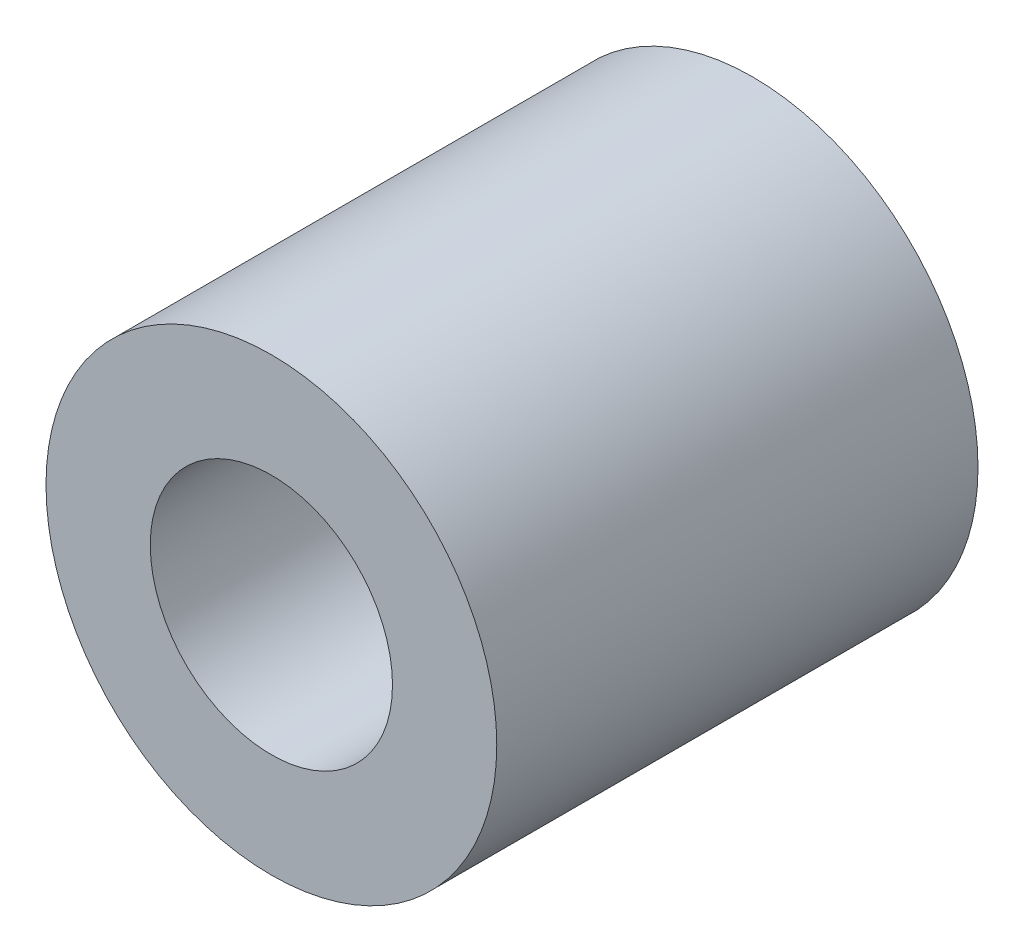
ISO-10303-21;
HEADER;
FILE_DESCRIPTION(('STEP AP214'),'2;1');
FILE_NAME('part.step','',(''),(''),'','','');
FILE_SCHEMA(('AUTOMOTIVE_DESIGN { 1 0 10303 214 1 1 1 1 }'));
ENDSEC;
DATA;
#1=APPLICATION_CONTEXT('core data for automotive mechanical design processes');
#2=APPLICATION_PROTOCOL_DEFINITION('international standard','automotive_design',2000,#1);
#3=PRODUCT_CONTEXT('',#1,'mechanical');
#4=PRODUCT('Part','Part','',(#3));
#5=PRODUCT_RELATED_PRODUCT_CATEGORY('part','',(#4));
#6=PRODUCT_DEFINITION_FORMATION('','',#4);
#7=PRODUCT_DEFINITION_CONTEXT('part definition',#1,'design');
#8=PRODUCT_DEFINITION('design','',#6,#7);
#9=PRODUCT_DEFINITION_SHAPE('','',#8);
#10=(LENGTH_UNIT() NAMED_UNIT(*) SI_UNIT(.MILLI.,.METRE.));
#11=(NAMED_UNIT(*) PLANE_ANGLE_UNIT() SI_UNIT($,.RADIAN.));
#12=(NAMED_UNIT(*) SI_UNIT($,.STERADIAN.) SOLID_ANGLE_UNIT());
#13=UNCERTAINTY_MEASURE_WITH_UNIT(LENGTH_MEASURE(1.E-05),#10,'distance_accuracy_value','');
#14=(GEOMETRIC_REPRESENTATION_CONTEXT(3) GLOBAL_UNCERTAINTY_ASSIGNED_CONTEXT((#13)) GLOBAL_UNIT_ASSIGNED_CONTEXT((#10,
#11,#12)) REPRESENTATION_CONTEXT('',''));
#15=CARTESIAN_POINT('',(0.,0.,0.));
#16=DIRECTION('',(0.,0.,1.));
#17=DIRECTION('',(1.,0.,0.));
#18=AXIS2_PLACEMENT_3D('',#15,#16,#17);
#19=CARTESIAN_POINT('',(0.,0.,3.));
#20=DIRECTION('',(0.,0.,-1.));
#21=DIRECTION('',(-1.,0.,0.));
#22=AXIS2_PLACEMENT_3D('',#19,#20,#21);
#23=CYLINDRICAL_SURFACE('',#22,1.405);
#24=CARTESIAN_POINT('',(0.,0.,3.));
#25=DIRECTION('',(0.,0.,1.));
#26=DIRECTION('',(1.,0.,0.));
#27=AXIS2_PLACEMENT_3D('',#24,#25,#26);
#28=CIRCLE('',#27,1.405);
#29=CARTESIAN_POINT('',(1.405,0.,3.));
#30=VERTEX_POINT('',#29);
#31=EDGE_CURVE('E10',#30,#30,#28,.T.);
#32=ORIENTED_EDGE('',*,*,#31,.F.);
#33=EDGE_LOOP('',(#32));
#34=FACE_BOUND('',#33,.T.);
#35=CARTESIAN_POINT('',(0.,0.,0.));
#36=DIRECTION('',(0.,0.,1.));
#37=DIRECTION('',(1.,0.,0.));
#38=AXIS2_PLACEMENT_3D('',#35,#36,#37);
#39=CIRCLE('',#38,1.405);
#40=CARTESIAN_POINT('',(1.405,0.,0.));
#41=VERTEX_POINT('',#40);
#42=EDGE_CURVE('E40',#41,#41,#39,.T.);
#43=ORIENTED_EDGE('',*,*,#42,.T.);
#44=EDGE_LOOP('',(#43));
#45=FACE_BOUND('',#44,.T.);
#46=ADVANCED_FACE('F37',(#34,#45),#23,.T.);
#47=CARTESIAN_POINT('',(0.,0.,3.));
#48=DIRECTION('',(0.,0.,1.));
#49=DIRECTION('',(1.,0.,0.));
#50=AXIS2_PLACEMENT_3D('',#47,#48,#49);
#51=PLANE('',#50);
#52=CARTESIAN_POINT('',(0.,0.,3.));
#53=DIRECTION('',(0.,0.,1.));
#54=DIRECTION('',(1.,0.,0.));
#55=AXIS2_PLACEMENT_3D('',#52,#53,#54);
#56=CIRCLE('',#55,0.755);
#57=CARTESIAN_POINT('',(0.755,0.,3.));
#58=VERTEX_POINT('',#57);
#59=EDGE_CURVE('E51',#58,#58,#56,.T.);
#60=ORIENTED_EDGE('',*,*,#59,.F.);
#61=EDGE_LOOP('',(#60));
#62=FACE_BOUND('',#61,.T.);
#63=ORIENTED_EDGE('',*,*,#31,.T.);
#64=EDGE_LOOP('',(#63));
#65=FACE_BOUND('',#64,.T.);
#66=ADVANCED_FACE('F68',(#62,#65),#51,.T.);
#67=CARTESIAN_POINT('',(0.,0.,0.));
#68=DIRECTION('',(0.,0.,1.));
#69=DIRECTION('',(1.,0.,0.));
#70=AXIS2_PLACEMENT_3D('',#67,#68,#69);
#71=PLANE('',#70);
#72=ORIENTED_EDGE('',*,*,#42,.F.);
#73=EDGE_LOOP('',(#72));
#74=FACE_BOUND('',#73,.T.);
#75=ADVANCED_FACE('F64',(#74),#71,.F.);
#76=CARTESIAN_POINT('',(0.,0.,0.2));
#77=DIRECTION('',(0.,0.,1.));
#78=DIRECTION('',(1.,0.,0.));
#79=AXIS2_PLACEMENT_3D('',#76,#77,#78);
#80=CYLINDRICAL_SURFACE('',#79,0.755);
#81=CARTESIAN_POINT('',(0.,0.,0.2));
#82=DIRECTION('',(0.,0.,1.));
#83=DIRECTION('',(1.,0.,0.));
#84=AXIS2_PLACEMENT_3D('',#81,#82,#83);
#85=CIRCLE('',#84,0.755);
#86=CARTESIAN_POINT('',(0.755,0.,0.2));
#87=VERTEX_POINT('',#86);
#88=EDGE_CURVE('E49',#87,#87,#85,.T.);
#89=ORIENTED_EDGE('',*,*,#88,.F.);
#90=EDGE_LOOP('',(#89));
#91=FACE_BOUND('',#90,.T.);
#92=ORIENTED_EDGE('',*,*,#59,.T.);
#93=EDGE_LOOP('',(#92));
#94=FACE_BOUND('',#93,.T.);
#95=ADVANCED_FACE('F61',(#91,#94),#80,.F.);
#96=CARTESIAN_POINT('',(0.,0.,0.2));
#97=DIRECTION('',(0.,0.,1.));
#98=DIRECTION('',(1.,0.,0.));
#99=AXIS2_PLACEMENT_3D('',#96,#97,#98);
#100=PLANE('',#99);
#101=ORIENTED_EDGE('',*,*,#88,.T.);
#102=EDGE_LOOP('',(#101));
#103=FACE_BOUND('',#102,.T.);
#104=ADVANCED_FACE('F59',(#103),#100,.T.);
#105=CLOSED_SHELL('',(#46,#66,#75,#95,#104));
#106=MANIFOLD_SOLID_BREP('B2',#105);
#107=ADVANCED_BREP_SHAPE_REPRESENTATION('',(#18,#106),#14);
#108=SHAPE_DEFINITION_REPRESENTATION(#9,#107);
ENDSEC;
END-ISO-10303-21;
